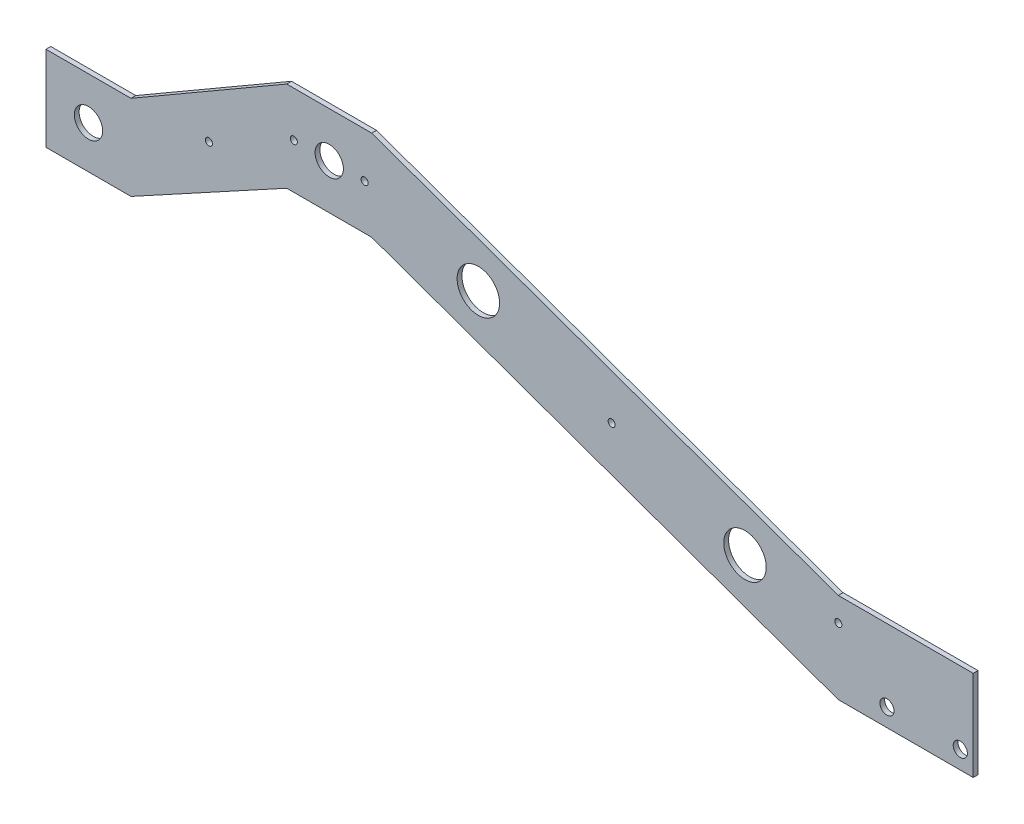
ISO-10303-21;
HEADER;
FILE_DESCRIPTION(('STEP AP214'),'2;1');
FILE_NAME('part.step','',(''),(''),'','','');
FILE_SCHEMA(('AUTOMOTIVE_DESIGN { 1 0 10303 214 1 1 1 1 }'));
ENDSEC;
DATA;
#1=APPLICATION_CONTEXT('core data for automotive mechanical design processes');
#2=APPLICATION_PROTOCOL_DEFINITION('international standard','automotive_design',2000,#1);
#3=PRODUCT_CONTEXT('',#1,'mechanical');
#4=PRODUCT('Part','Part','',(#3));
#5=PRODUCT_RELATED_PRODUCT_CATEGORY('part','',(#4));
#6=PRODUCT_DEFINITION_FORMATION('','',#4);
#7=PRODUCT_DEFINITION_CONTEXT('part definition',#1,'design');
#8=PRODUCT_DEFINITION('design','',#6,#7);
#9=PRODUCT_DEFINITION_SHAPE('','',#8);
#10=(LENGTH_UNIT() NAMED_UNIT(*) SI_UNIT(.MILLI.,.METRE.));
#11=(NAMED_UNIT(*) PLANE_ANGLE_UNIT() SI_UNIT($,.RADIAN.));
#12=(NAMED_UNIT(*) SI_UNIT($,.STERADIAN.) SOLID_ANGLE_UNIT());
#13=UNCERTAINTY_MEASURE_WITH_UNIT(LENGTH_MEASURE(1.E-05),#10,'distance_accuracy_value','');
#14=(GEOMETRIC_REPRESENTATION_CONTEXT(3) GLOBAL_UNCERTAINTY_ASSIGNED_CONTEXT((#13)) GLOBAL_UNIT_ASSIGNED_CONTEXT((#10,
#11,#12)) REPRESENTATION_CONTEXT('',''));
#15=CARTESIAN_POINT('',(0.,0.,0.));
#16=DIRECTION('',(0.,0.,1.));
#17=DIRECTION('',(1.,0.,0.));
#18=AXIS2_PLACEMENT_3D('',#15,#16,#17);
#19=CARTESIAN_POINT('',(0.,63.7314328894491,-3.4));
#20=DIRECTION('',(0.,1.,0.));
#21=DIRECTION('',(-1.,0.,0.));
#22=AXIS2_PLACEMENT_3D('',#19,#20,#21);
#23=PLANE('',#22);
#24=DIRECTION('',(-1.,0.,0.));
#25=VECTOR('',#24,1.);
#26=CARTESIAN_POINT('',(0.,63.7314328894491,0.));
#27=LINE('',#26,#25);
#28=CARTESIAN_POINT('',(0.,63.7314328894491,0.));
#29=VERTEX_POINT('',#28);
#30=CARTESIAN_POINT('',(-95.2463036271757,63.7314328894491,0.));
#31=VERTEX_POINT('',#30);
#32=EDGE_CURVE('E159',#29,#31,#27,.T.);
#33=ORIENTED_EDGE('',*,*,#32,.F.);
#34=DIRECTION('',(0.,0.,1.));
#35=VECTOR('',#34,1.);
#36=CARTESIAN_POINT('',(0.,63.7314328894491,-3.4));
#37=LINE('',#36,#35);
#38=CARTESIAN_POINT('',(0.,63.7314328894491,-3.4));
#39=VERTEX_POINT('',#38);
#40=EDGE_CURVE('E11',#39,#29,#37,.T.);
#41=ORIENTED_EDGE('',*,*,#40,.F.);
#42=DIRECTION('',(-1.,0.,0.));
#43=VECTOR('',#42,1.);
#44=CARTESIAN_POINT('',(0.,63.7314328894491,-3.4));
#45=LINE('',#44,#43);
#46=CARTESIAN_POINT('',(-95.2463036271757,63.7314328894491,-3.4));
#47=VERTEX_POINT('',#46);
#48=EDGE_CURVE('E192',#39,#47,#45,.T.);
#49=ORIENTED_EDGE('',*,*,#48,.T.);
#50=DIRECTION('',(0.,0.,1.));
#51=VECTOR('',#50,1.);
#52=CARTESIAN_POINT('',(-95.2463036271757,63.7314328894491,-3.4));
#53=LINE('',#52,#51);
#54=EDGE_CURVE('E41',#47,#31,#53,.T.);
#55=ORIENTED_EDGE('',*,*,#54,.T.);
#56=EDGE_LOOP('',(#33,#41,#49,#55));
#57=FACE_BOUND('',#56,.T.);
#58=ADVANCED_FACE('F38',(#57),#23,.T.);
#59=CARTESIAN_POINT('',(0.,63.7314328894491,-3.4));
#60=DIRECTION('',(1.,0.,0.));
#61=DIRECTION('',(0.,1.,0.));
#62=AXIS2_PLACEMENT_3D('',#59,#60,#61);
#63=PLANE('',#62);
#64=DIRECTION('',(0.,1.,0.));
#65=VECTOR('',#64,1.);
#66=CARTESIAN_POINT('',(0.,63.7314328894491,0.));
#67=LINE('',#66,#65);
#68=CARTESIAN_POINT('',(0.,0.,0.));
#69=VERTEX_POINT('',#68);
#70=EDGE_CURVE('E190',#69,#29,#67,.T.);
#71=ORIENTED_EDGE('',*,*,#70,.F.);
#72=DIRECTION('',(0.,0.,1.));
#73=VECTOR('',#72,1.);
#74=CARTESIAN_POINT('',(0.,0.,-3.4));
#75=LINE('',#74,#73);
#76=CARTESIAN_POINT('',(0.,0.,-3.4));
#77=VERTEX_POINT('',#76);
#78=EDGE_CURVE('E47',#77,#69,#75,.T.);
#79=ORIENTED_EDGE('',*,*,#78,.F.);
#80=DIRECTION('',(0.,1.,0.));
#81=VECTOR('',#80,1.);
#82=CARTESIAN_POINT('',(0.,63.7314328894491,-3.4));
#83=LINE('',#82,#81);
#84=EDGE_CURVE('E149',#77,#39,#83,.T.);
#85=ORIENTED_EDGE('',*,*,#84,.T.);
#86=ORIENTED_EDGE('',*,*,#40,.T.);
#87=EDGE_LOOP('',(#71,#79,#85,#86));
#88=FACE_BOUND('',#87,.T.);
#89=ADVANCED_FACE('F212',(#88),#63,.T.);
#90=CARTESIAN_POINT('',(0.,0.,-3.4));
#91=DIRECTION('',(0.,-1.,0.));
#92=DIRECTION('',(1.,0.,0.));
#93=AXIS2_PLACEMENT_3D('',#90,#91,#92);
#94=PLANE('',#93);
#95=DIRECTION('',(1.,0.,0.));
#96=VECTOR('',#95,1.);
#97=CARTESIAN_POINT('',(0.,0.,0.));
#98=LINE('',#97,#96);
#99=CARTESIAN_POINT('',(-95.2463036271756,0.,0.));
#100=VERTEX_POINT('',#99);
#101=EDGE_CURVE('E136',#100,#69,#98,.T.);
#102=ORIENTED_EDGE('',*,*,#101,.F.);
#103=DIRECTION('',(0.,0.,1.));
#104=VECTOR('',#103,1.);
#105=CARTESIAN_POINT('',(-95.2463036271756,0.,-3.4));
#106=LINE('',#105,#104);
#107=CARTESIAN_POINT('',(-95.2463036271756,0.,-3.4));
#108=VERTEX_POINT('',#107);
#109=EDGE_CURVE('E131',#108,#100,#106,.T.);
#110=ORIENTED_EDGE('',*,*,#109,.F.);
#111=DIRECTION('',(1.,0.,0.));
#112=VECTOR('',#111,1.);
#113=CARTESIAN_POINT('',(0.,0.,-3.4));
#114=LINE('',#113,#112);
#115=EDGE_CURVE('E134',#108,#77,#114,.T.);
#116=ORIENTED_EDGE('',*,*,#115,.T.);
#117=ORIENTED_EDGE('',*,*,#78,.T.);
#118=EDGE_LOOP('',(#102,#110,#116,#117));
#119=FACE_BOUND('',#118,.T.);
#120=ADVANCED_FACE('F133',(#119),#94,.T.);
#121=CARTESIAN_POINT('',(-424.746303627176,118.,-3.4));
#122=DIRECTION('',(-0.337150769957865,-0.941450666958614,0.));
#123=DIRECTION('',(0.941450666958614,-0.337150769957865,0.));
#124=AXIS2_PLACEMENT_3D('',#121,#122,#123);
#125=PLANE('',#124);
#126=DIRECTION('',(0.941450666958614,-0.337150769957865,0.));
#127=VECTOR('',#126,1.);
#128=CARTESIAN_POINT('',(-424.746303627176,118.,0.));
#129=LINE('',#128,#127);
#130=CARTESIAN_POINT('',(-424.746303627176,118.,0.));
#131=VERTEX_POINT('',#130);
#132=EDGE_CURVE('E187',#131,#100,#129,.T.);
#133=ORIENTED_EDGE('',*,*,#132,.F.);
#134=DIRECTION('',(0.,0.,1.));
#135=VECTOR('',#134,1.);
#136=CARTESIAN_POINT('',(-424.746303627176,118.,-3.4));
#137=LINE('',#136,#135);
#138=CARTESIAN_POINT('',(-424.746303627176,118.,-3.4));
#139=VERTEX_POINT('',#138);
#140=EDGE_CURVE('E141',#139,#131,#137,.T.);
#141=ORIENTED_EDGE('',*,*,#140,.F.);
#142=DIRECTION('',(0.941450666958614,-0.337150769957865,0.));
#143=VECTOR('',#142,1.);
#144=CARTESIAN_POINT('',(-424.746303627176,118.,-3.4));
#145=LINE('',#144,#143);
#146=EDGE_CURVE('E147',#139,#108,#145,.T.);
#147=ORIENTED_EDGE('',*,*,#146,.T.);
#148=ORIENTED_EDGE('',*,*,#109,.T.);
#149=EDGE_LOOP('',(#133,#141,#147,#148));
#150=FACE_BOUND('',#149,.T.);
#151=ADVANCED_FACE('F151',(#150),#125,.T.);
#152=CARTESIAN_POINT('',(-484.746303627176,118.,-3.4));
#153=DIRECTION('',(0.,-1.,0.));
#154=DIRECTION('',(0.,0.,-1.));
#155=AXIS2_PLACEMENT_3D('',#152,#153,#154);
#156=PLANE('',#155);
#157=DIRECTION('',(1.,0.,0.));
#158=VECTOR('',#157,1.);
#159=CARTESIAN_POINT('',(-484.746303627176,118.,0.));
#160=LINE('',#159,#158);
#161=CARTESIAN_POINT('',(-484.746303627176,118.,0.));
#162=VERTEX_POINT('',#161);
#163=EDGE_CURVE('E184',#162,#131,#160,.T.);
#164=ORIENTED_EDGE('',*,*,#163,.F.);
#165=DIRECTION('',(0.,0.,1.));
#166=VECTOR('',#165,1.);
#167=CARTESIAN_POINT('',(-484.746303627176,118.,-3.4));
#168=LINE('',#167,#166);
#169=CARTESIAN_POINT('',(-484.746303627176,118.,-3.4));
#170=VERTEX_POINT('',#169);
#171=EDGE_CURVE('E196',#170,#162,#168,.T.);
#172=ORIENTED_EDGE('',*,*,#171,.F.);
#173=DIRECTION('',(1.,0.,0.));
#174=VECTOR('',#173,1.);
#175=CARTESIAN_POINT('',(-484.746303627176,118.,-3.4));
#176=LINE('',#175,#174);
#177=EDGE_CURVE('E152',#170,#139,#176,.T.);
#178=ORIENTED_EDGE('',*,*,#177,.T.);
#179=ORIENTED_EDGE('',*,*,#140,.T.);
#180=EDGE_LOOP('',(#164,#172,#178,#179));
#181=FACE_BOUND('',#180,.T.);
#182=ADVANCED_FACE('F225',(#181),#156,.T.);
#183=CARTESIAN_POINT('',(-594.746303627176,58.,-3.4));
#184=DIRECTION('',(0.478852130680573,-0.877895572914384,0.));
#185=DIRECTION('',(0.877895572914384,0.478852130680573,0.));
#186=AXIS2_PLACEMENT_3D('',#183,#184,#185);
#187=PLANE('',#186);
#188=DIRECTION('',(0.877895572914384,0.478852130680573,0.));
#189=VECTOR('',#188,1.);
#190=CARTESIAN_POINT('',(-594.746303627176,58.,0.));
#191=LINE('',#190,#189);
#192=CARTESIAN_POINT('',(-594.746303627176,58.,0.));
#193=VERTEX_POINT('',#192);
#194=EDGE_CURVE('E181',#193,#162,#191,.T.);
#195=ORIENTED_EDGE('',*,*,#194,.F.);
#196=DIRECTION('',(0.,0.,1.));
#197=VECTOR('',#196,1.);
#198=CARTESIAN_POINT('',(-594.746303627176,58.,-3.4));
#199=LINE('',#198,#197);
#200=CARTESIAN_POINT('',(-594.746303627176,58.,-3.4));
#201=VERTEX_POINT('',#200);
#202=EDGE_CURVE('E198',#201,#193,#199,.T.);
#203=ORIENTED_EDGE('',*,*,#202,.F.);
#204=DIRECTION('',(0.877895572914384,0.478852130680573,0.));
#205=VECTOR('',#204,1.);
#206=CARTESIAN_POINT('',(-594.746303627176,58.,-3.4));
#207=LINE('',#206,#205);
#208=EDGE_CURVE('E154',#201,#170,#207,.T.);
#209=ORIENTED_EDGE('',*,*,#208,.T.);
#210=ORIENTED_EDGE('',*,*,#171,.T.);
#211=EDGE_LOOP('',(#195,#203,#209,#210));
#212=FACE_BOUND('',#211,.T.);
#213=ADVANCED_FACE('F228',(#212),#187,.T.);
#214=CARTESIAN_POINT('',(-654.746303627176,58.,-3.4));
#215=DIRECTION('',(0.,-1.,0.));
#216=DIRECTION('',(0.,0.,-1.));
#217=AXIS2_PLACEMENT_3D('',#214,#215,#216);
#218=PLANE('',#217);
#219=DIRECTION('',(1.,0.,0.));
#220=VECTOR('',#219,1.);
#221=CARTESIAN_POINT('',(-654.746303627176,58.,0.));
#222=LINE('',#221,#220);
#223=CARTESIAN_POINT('',(-654.746303627176,58.,0.));
#224=VERTEX_POINT('',#223);
#225=EDGE_CURVE('E178',#224,#193,#222,.T.);
#226=ORIENTED_EDGE('',*,*,#225,.F.);
#227=DIRECTION('',(0.,0.,1.));
#228=VECTOR('',#227,1.);
#229=CARTESIAN_POINT('',(-654.746303627176,58.,-3.4));
#230=LINE('',#229,#228);
#231=CARTESIAN_POINT('',(-654.746303627176,58.,-3.4));
#232=VERTEX_POINT('',#231);
#233=EDGE_CURVE('E200',#232,#224,#230,.T.);
#234=ORIENTED_EDGE('',*,*,#233,.F.);
#235=DIRECTION('',(1.,0.,0.));
#236=VECTOR('',#235,1.);
#237=CARTESIAN_POINT('',(-654.746303627176,58.,-3.4));
#238=LINE('',#237,#236);
#239=EDGE_CURVE('E392',#232,#201,#238,.T.);
#240=ORIENTED_EDGE('',*,*,#239,.T.);
#241=ORIENTED_EDGE('',*,*,#202,.T.);
#242=EDGE_LOOP('',(#226,#234,#240,#241));
#243=FACE_BOUND('',#242,.T.);
#244=ADVANCED_FACE('F232',(#243),#218,.T.);
#245=CARTESIAN_POINT('',(-654.746303627176,118.,-3.4));
#246=DIRECTION('',(-1.,0.,0.));
#247=DIRECTION('',(0.,0.,1.));
#248=AXIS2_PLACEMENT_3D('',#245,#246,#247);
#249=PLANE('',#248);
#250=DIRECTION('',(0.,-1.,0.));
#251=VECTOR('',#250,1.);
#252=CARTESIAN_POINT('',(-654.746303627176,118.,0.));
#253=LINE('',#252,#251);
#254=CARTESIAN_POINT('',(-654.746303627176,118.,0.));
#255=VERTEX_POINT('',#254);
#256=EDGE_CURVE('E175',#255,#224,#253,.T.);
#257=ORIENTED_EDGE('',*,*,#256,.F.);
#258=DIRECTION('',(0.,0.,1.));
#259=VECTOR('',#258,1.);
#260=CARTESIAN_POINT('',(-654.746303627176,118.,-3.4));
#261=LINE('',#260,#259);
#262=CARTESIAN_POINT('',(-654.746303627176,118.,-3.4));
#263=VERTEX_POINT('',#262);
#264=EDGE_CURVE('E202',#263,#255,#261,.T.);
#265=ORIENTED_EDGE('',*,*,#264,.F.);
#266=DIRECTION('',(0.,-1.,0.));
#267=VECTOR('',#266,1.);
#268=CARTESIAN_POINT('',(-654.746303627176,118.,-3.4));
#269=LINE('',#268,#267);
#270=EDGE_CURVE('E389',#263,#232,#269,.T.);
#271=ORIENTED_EDGE('',*,*,#270,.T.);
#272=ORIENTED_EDGE('',*,*,#233,.T.);
#273=EDGE_LOOP('',(#257,#265,#271,#272));
#274=FACE_BOUND('',#273,.T.);
#275=ADVANCED_FACE('F236',(#274),#249,.T.);
#276=CARTESIAN_POINT('',(-594.746303627176,118.,-3.4));
#277=DIRECTION('',(0.,1.,0.));
#278=DIRECTION('',(-1.,0.,0.));
#279=AXIS2_PLACEMENT_3D('',#276,#277,#278);
#280=PLANE('',#279);
#281=DIRECTION('',(-1.,0.,0.));
#282=VECTOR('',#281,1.);
#283=CARTESIAN_POINT('',(-594.746303627176,118.,0.));
#284=LINE('',#283,#282);
#285=CARTESIAN_POINT('',(-594.746303627176,118.,0.));
#286=VERTEX_POINT('',#285);
#287=EDGE_CURVE('E172',#286,#255,#284,.T.);
#288=ORIENTED_EDGE('',*,*,#287,.F.);
#289=DIRECTION('',(0.,0.,1.));
#290=VECTOR('',#289,1.);
#291=CARTESIAN_POINT('',(-594.746303627176,118.,-3.4));
#292=LINE('',#291,#290);
#293=CARTESIAN_POINT('',(-594.746303627176,118.,-3.4));
#294=VERTEX_POINT('',#293);
#295=EDGE_CURVE('E204',#294,#286,#292,.T.);
#296=ORIENTED_EDGE('',*,*,#295,.F.);
#297=DIRECTION('',(-1.,0.,0.));
#298=VECTOR('',#297,1.);
#299=CARTESIAN_POINT('',(-594.746303627176,118.,-3.4));
#300=LINE('',#299,#298);
#301=EDGE_CURVE('E386',#294,#263,#300,.T.);
#302=ORIENTED_EDGE('',*,*,#301,.T.);
#303=ORIENTED_EDGE('',*,*,#264,.T.);
#304=EDGE_LOOP('',(#288,#296,#302,#303));
#305=FACE_BOUND('',#304,.T.);
#306=ADVANCED_FACE('F240',(#305),#280,.T.);
#307=CARTESIAN_POINT('',(-484.746303627176,181.731432889449,-3.4));
#308=DIRECTION('',(-0.501314449325586,0.865265174901535,0.));
#309=DIRECTION('',(-0.865265174901535,-0.501314449325587,0.));
#310=AXIS2_PLACEMENT_3D('',#307,#308,#309);
#311=PLANE('',#310);
#312=DIRECTION('',(-0.865265174901535,-0.501314449325586,0.));
#313=VECTOR('',#312,1.);
#314=CARTESIAN_POINT('',(-484.746303627176,181.731432889449,0.));
#315=LINE('',#314,#313);
#316=CARTESIAN_POINT('',(-484.746303627176,181.731432889449,0.));
#317=VERTEX_POINT('',#316);
#318=EDGE_CURVE('E169',#317,#286,#315,.T.);
#319=ORIENTED_EDGE('',*,*,#318,.F.);
#320=DIRECTION('',(0.,0.,1.));
#321=VECTOR('',#320,1.);
#322=CARTESIAN_POINT('',(-484.746303627176,181.731432889449,-3.4));
#323=LINE('',#322,#321);
#324=CARTESIAN_POINT('',(-484.746303627176,181.731432889449,-3.4));
#325=VERTEX_POINT('',#324);
#326=EDGE_CURVE('E206',#325,#317,#323,.T.);
#327=ORIENTED_EDGE('',*,*,#326,.F.);
#328=DIRECTION('',(-0.865265174901535,-0.501314449325586,0.));
#329=VECTOR('',#328,1.);
#330=CARTESIAN_POINT('',(-484.746303627176,181.731432889449,-3.4));
#331=LINE('',#330,#329);
#332=EDGE_CURVE('E383',#325,#294,#331,.T.);
#333=ORIENTED_EDGE('',*,*,#332,.T.);
#334=ORIENTED_EDGE('',*,*,#295,.T.);
#335=EDGE_LOOP('',(#319,#327,#333,#334));
#336=FACE_BOUND('',#335,.T.);
#337=ADVANCED_FACE('F244',(#336),#311,.T.);
#338=CARTESIAN_POINT('',(-424.746303627176,181.731432889449,-3.4));
#339=DIRECTION('',(0.,1.,0.));
#340=DIRECTION('',(-1.,0.,0.));
#341=AXIS2_PLACEMENT_3D('',#338,#339,#340);
#342=PLANE('',#341);
#343=DIRECTION('',(-1.,0.,0.));
#344=VECTOR('',#343,1.);
#345=CARTESIAN_POINT('',(-424.746303627176,181.731432889449,0.));
#346=LINE('',#345,#344);
#347=CARTESIAN_POINT('',(-424.746303627176,181.731432889449,0.));
#348=VERTEX_POINT('',#347);
#349=EDGE_CURVE('E166',#348,#317,#346,.T.);
#350=ORIENTED_EDGE('',*,*,#349,.F.);
#351=DIRECTION('',(0.,0.,1.));
#352=VECTOR('',#351,1.);
#353=CARTESIAN_POINT('',(-424.746303627176,181.731432889449,-3.4));
#354=LINE('',#353,#352);
#355=CARTESIAN_POINT('',(-424.746303627176,181.731432889449,-3.4));
#356=VERTEX_POINT('',#355);
#357=EDGE_CURVE('E207',#356,#348,#354,.T.);
#358=ORIENTED_EDGE('',*,*,#357,.F.);
#359=DIRECTION('',(-1.,0.,0.));
#360=VECTOR('',#359,1.);
#361=CARTESIAN_POINT('',(-424.746303627176,181.731432889449,-3.4));
#362=LINE('',#361,#360);
#363=EDGE_CURVE('E380',#356,#325,#362,.T.);
#364=ORIENTED_EDGE('',*,*,#363,.T.);
#365=ORIENTED_EDGE('',*,*,#326,.T.);
#366=EDGE_LOOP('',(#350,#358,#364,#365));
#367=FACE_BOUND('',#366,.T.);
#368=ADVANCED_FACE('F248',(#367),#342,.T.);
#369=CARTESIAN_POINT('',(-95.2463036271757,63.7314328894491,-3.4));
#370=DIRECTION('',(0.337150769957864,0.941450666958614,0.));
#371=DIRECTION('',(-0.941450666958614,0.337150769957864,0.));
#372=AXIS2_PLACEMENT_3D('',#369,#370,#371);
#373=PLANE('',#372);
#374=DIRECTION('',(-0.941450666958614,0.337150769957864,0.));
#375=VECTOR('',#374,1.);
#376=CARTESIAN_POINT('',(-95.2463036271757,63.7314328894491,0.));
#377=LINE('',#376,#375);
#378=EDGE_CURVE('E162',#31,#348,#377,.T.);
#379=ORIENTED_EDGE('',*,*,#378,.F.);
#380=ORIENTED_EDGE('',*,*,#54,.F.);
#381=DIRECTION('',(-0.941450666958614,0.337150769957864,0.));
#382=VECTOR('',#381,1.);
#383=CARTESIAN_POINT('',(-95.2463036271757,63.7314328894491,-3.4));
#384=LINE('',#383,#382);
#385=EDGE_CURVE('E378',#47,#356,#384,.T.);
#386=ORIENTED_EDGE('',*,*,#385,.T.);
#387=ORIENTED_EDGE('',*,*,#357,.T.);
#388=EDGE_LOOP('',(#379,#380,#386,#387));
#389=FACE_BOUND('',#388,.T.);
#390=ADVANCED_FACE('F209',(#389),#373,.T.);
#391=CARTESIAN_POINT('',(0.,0.,-3.4));
#392=DIRECTION('',(0.,0.,1.));
#393=DIRECTION('',(1.,0.,0.));
#394=AXIS2_PLACEMENT_3D('',#391,#392,#393);
#395=PLANE('',#394);
#396=CARTESIAN_POINT('',(-9.1,12.7,-3.4));
#397=DIRECTION('',(0.,0.,1.));
#398=DIRECTION('',(-1.,0.,0.));
#399=AXIS2_PLACEMENT_3D('',#396,#397,#398);
#400=CIRCLE('',#399,5.);
#401=CARTESIAN_POINT('',(-14.1,12.7,-3.4));
#402=VERTEX_POINT('',#401);
#403=EDGE_CURVE('E311',#402,#402,#400,.T.);
#404=ORIENTED_EDGE('',*,*,#403,.T.);
#405=EDGE_LOOP('',(#404));
#406=FACE_BOUND('',#405,.T.);
#407=CARTESIAN_POINT('',(-95.2463036271757,46.8657164447245,-3.4));
#408=DIRECTION('',(0.,0.,1.));
#409=DIRECTION('',(1.,0.,0.));
#410=AXIS2_PLACEMENT_3D('',#407,#408,#409);
#411=CIRCLE('',#410,2.50000000000001);
#412=CARTESIAN_POINT('',(-92.7463036271756,46.8657164447245,-3.4));
#413=VERTEX_POINT('',#412);
#414=EDGE_CURVE('E319',#413,#413,#411,.T.);
#415=ORIENTED_EDGE('',*,*,#414,.T.);
#416=EDGE_LOOP('',(#415));
#417=FACE_BOUND('',#416,.T.);
#418=CARTESIAN_POINT('',(-60.9,12.7,-3.4));
#419=DIRECTION('',(0.,0.,1.));
#420=DIRECTION('',(1.,0.,0.));
#421=AXIS2_PLACEMENT_3D('',#418,#419,#420);
#422=CIRCLE('',#421,5.);
#423=CARTESIAN_POINT('',(-55.9,12.7,-3.4));
#424=VERTEX_POINT('',#423);
#425=EDGE_CURVE('E325',#424,#424,#422,.T.);
#426=ORIENTED_EDGE('',*,*,#425,.T.);
#427=EDGE_LOOP('',(#426));
#428=FACE_BOUND('',#427,.T.);
#429=CARTESIAN_POINT('',(-479.746303627176,149.865716444724,-3.4));
#430=DIRECTION('',(0.,0.,1.));
#431=DIRECTION('',(1.,0.,0.));
#432=AXIS2_PLACEMENT_3D('',#429,#430,#431);
#433=CIRCLE('',#432,2.50000000000002);
#434=CARTESIAN_POINT('',(-477.246303627176,149.865716444724,-3.4));
#435=VERTEX_POINT('',#434);
#436=EDGE_CURVE('E331',#435,#435,#433,.T.);
#437=ORIENTED_EDGE('',*,*,#436,.T.);
#438=EDGE_LOOP('',(#437));
#439=FACE_BOUND('',#438,.T.);
#440=CARTESIAN_POINT('',(-429.746303627176,149.865716444724,-3.4));
#441=DIRECTION('',(0.,0.,1.));
#442=DIRECTION('',(1.,0.,0.));
#443=AXIS2_PLACEMENT_3D('',#440,#441,#442);
#444=CIRCLE('',#443,2.50000000000002);
#445=CARTESIAN_POINT('',(-427.246303627176,149.865716444724,-3.4));
#446=VERTEX_POINT('',#445);
#447=EDGE_CURVE('E337',#446,#446,#444,.T.);
#448=ORIENTED_EDGE('',*,*,#447,.T.);
#449=EDGE_LOOP('',(#448));
#450=FACE_BOUND('',#449,.T.);
#451=CARTESIAN_POINT('',(-349.437983706001,122.896424333348,-3.4));
#452=DIRECTION('',(0.,0.,1.));
#453=DIRECTION('',(1.,0.,0.));
#454=AXIS2_PLACEMENT_3D('',#451,#452,#453);
#455=CIRCLE('',#454,15.);
#456=CARTESIAN_POINT('',(-334.437983706001,122.896424333348,-3.4));
#457=VERTEX_POINT('',#456);
#458=EDGE_CURVE('E343',#457,#457,#455,.T.);
#459=ORIENTED_EDGE('',*,*,#458,.T.);
#460=EDGE_LOOP('',(#459));
#461=FACE_BOUND('',#460,.T.);
#462=CARTESIAN_POINT('',(-255.29291701014,89.1813473375615,-3.4));
#463=DIRECTION('',(0.,0.,1.));
#464=DIRECTION('',(1.,0.,0.));
#465=AXIS2_PLACEMENT_3D('',#462,#463,#464);
#466=CIRCLE('',#465,2.50000000000002);
#467=CARTESIAN_POINT('',(-252.79291701014,89.1813473375615,-3.4));
#468=VERTEX_POINT('',#467);
#469=EDGE_CURVE('E349',#468,#468,#466,.T.);
#470=ORIENTED_EDGE('',*,*,#469,.T.);
#471=EDGE_LOOP('',(#470));
#472=FACE_BOUND('',#471,.T.);
#473=CARTESIAN_POINT('',(-161.147850314279,55.466270341775,-3.4));
#474=DIRECTION('',(0.,0.,1.));
#475=DIRECTION('',(1.,0.,0.));
#476=AXIS2_PLACEMENT_3D('',#473,#474,#475);
#477=CIRCLE('',#476,15.);
#478=CARTESIAN_POINT('',(-146.147850314279,55.466270341775,-3.4));
#479=VERTEX_POINT('',#478);
#480=EDGE_CURVE('E355',#479,#479,#477,.T.);
#481=ORIENTED_EDGE('',*,*,#480,.T.);
#482=EDGE_LOOP('',(#481));
#483=FACE_BOUND('',#482,.T.);
#484=CARTESIAN_POINT('',(-539.746303627176,118.932858222362,-3.4));
#485=DIRECTION('',(0.,0.,1.));
#486=DIRECTION('',(1.,0.,0.));
#487=AXIS2_PLACEMENT_3D('',#484,#485,#486);
#488=CIRCLE('',#487,2.49999999999991);
#489=CARTESIAN_POINT('',(-537.246303627176,118.932858222362,-3.4));
#490=VERTEX_POINT('',#489);
#491=EDGE_CURVE('E361',#490,#490,#488,.T.);
#492=ORIENTED_EDGE('',*,*,#491,.T.);
#493=EDGE_LOOP('',(#492));
#494=FACE_BOUND('',#493,.T.);
#495=CARTESIAN_POINT('',(-454.746303627176,149.865716444724,-3.4));
#496=DIRECTION('',(0.,0.,1.));
#497=DIRECTION('',(1.,0.,0.));
#498=AXIS2_PLACEMENT_3D('',#495,#496,#497);
#499=CIRCLE('',#498,9.99999999999998);
#500=CARTESIAN_POINT('',(-444.746303627176,149.865716444724,-3.4));
#501=VERTEX_POINT('',#500);
#502=EDGE_CURVE('E367',#501,#501,#499,.T.);
#503=ORIENTED_EDGE('',*,*,#502,.T.);
#504=EDGE_LOOP('',(#503));
#505=FACE_BOUND('',#504,.T.);
#506=CARTESIAN_POINT('',(-624.746303627176,88.,-3.4));
#507=DIRECTION('',(0.,0.,1.));
#508=DIRECTION('',(1.,0.,0.));
#509=AXIS2_PLACEMENT_3D('',#506,#507,#508);
#510=CIRCLE('',#509,9.99999999999998);
#511=CARTESIAN_POINT('',(-614.746303627176,88.,-3.4));
#512=VERTEX_POINT('',#511);
#513=EDGE_CURVE('E163',#512,#512,#510,.T.);
#514=ORIENTED_EDGE('',*,*,#513,.T.);
#515=EDGE_LOOP('',(#514));
#516=FACE_BOUND('',#515,.T.);
#517=ORIENTED_EDGE('',*,*,#48,.F.);
#518=ORIENTED_EDGE('',*,*,#84,.F.);
#519=ORIENTED_EDGE('',*,*,#115,.F.);
#520=ORIENTED_EDGE('',*,*,#146,.F.);
#521=ORIENTED_EDGE('',*,*,#177,.F.);
#522=ORIENTED_EDGE('',*,*,#208,.F.);
#523=ORIENTED_EDGE('',*,*,#239,.F.);
#524=ORIENTED_EDGE('',*,*,#270,.F.);
#525=ORIENTED_EDGE('',*,*,#301,.F.);
#526=ORIENTED_EDGE('',*,*,#332,.F.);
#527=ORIENTED_EDGE('',*,*,#363,.F.);
#528=ORIENTED_EDGE('',*,*,#385,.F.);
#529=EDGE_LOOP('',(#517,#518,#519,#520,#521,#522,#523,#524,#525,#526,#527,#528));
#530=FACE_BOUND('',#529,.T.);
#531=ADVANCED_FACE('F145',(#406,#417,#428,#439,#450,#461,#472,#483,#494,#505,#516,#530),#395,.F.);
#532=CARTESIAN_POINT('',(0.,0.,0.));
#533=DIRECTION('',(0.,0.,1.));
#534=DIRECTION('',(1.,0.,0.));
#535=AXIS2_PLACEMENT_3D('',#532,#533,#534);
#536=PLANE('',#535);
#537=CARTESIAN_POINT('',(-9.1,12.7,0.));
#538=DIRECTION('',(0.,0.,1.));
#539=DIRECTION('',(-1.,0.,0.));
#540=AXIS2_PLACEMENT_3D('',#537,#538,#539);
#541=CIRCLE('',#540,5.);
#542=CARTESIAN_POINT('',(-14.1,12.7,0.));
#543=VERTEX_POINT('',#542);
#544=EDGE_CURVE('E314',#543,#543,#541,.T.);
#545=ORIENTED_EDGE('',*,*,#544,.F.);
#546=EDGE_LOOP('',(#545));
#547=FACE_BOUND('',#546,.T.);
#548=CARTESIAN_POINT('',(-95.2463036271757,46.8657164447245,0.));
#549=DIRECTION('',(0.,0.,1.));
#550=DIRECTION('',(1.,0.,0.));
#551=AXIS2_PLACEMENT_3D('',#548,#549,#550);
#552=CIRCLE('',#551,2.50000000000001);
#553=CARTESIAN_POINT('',(-92.7463036271756,46.8657164447245,0.));
#554=VERTEX_POINT('',#553);
#555=EDGE_CURVE('E316',#554,#554,#552,.T.);
#556=ORIENTED_EDGE('',*,*,#555,.F.);
#557=EDGE_LOOP('',(#556));
#558=FACE_BOUND('',#557,.T.);
#559=CARTESIAN_POINT('',(-60.9,12.7,0.));
#560=DIRECTION('',(0.,0.,1.));
#561=DIRECTION('',(1.,0.,0.));
#562=AXIS2_PLACEMENT_3D('',#559,#560,#561);
#563=CIRCLE('',#562,5.);
#564=CARTESIAN_POINT('',(-55.9,12.7,0.));
#565=VERTEX_POINT('',#564);
#566=EDGE_CURVE('E322',#565,#565,#563,.T.);
#567=ORIENTED_EDGE('',*,*,#566,.F.);
#568=EDGE_LOOP('',(#567));
#569=FACE_BOUND('',#568,.T.);
#570=CARTESIAN_POINT('',(-479.746303627176,149.865716444724,0.));
#571=DIRECTION('',(0.,0.,1.));
#572=DIRECTION('',(1.,0.,0.));
#573=AXIS2_PLACEMENT_3D('',#570,#571,#572);
#574=CIRCLE('',#573,2.50000000000002);
#575=CARTESIAN_POINT('',(-477.246303627176,149.865716444724,0.));
#576=VERTEX_POINT('',#575);
#577=EDGE_CURVE('E328',#576,#576,#574,.T.);
#578=ORIENTED_EDGE('',*,*,#577,.F.);
#579=EDGE_LOOP('',(#578));
#580=FACE_BOUND('',#579,.T.);
#581=CARTESIAN_POINT('',(-429.746303627176,149.865716444724,0.));
#582=DIRECTION('',(0.,0.,1.));
#583=DIRECTION('',(1.,0.,0.));
#584=AXIS2_PLACEMENT_3D('',#581,#582,#583);
#585=CIRCLE('',#584,2.50000000000002);
#586=CARTESIAN_POINT('',(-427.246303627176,149.865716444724,0.));
#587=VERTEX_POINT('',#586);
#588=EDGE_CURVE('E334',#587,#587,#585,.T.);
#589=ORIENTED_EDGE('',*,*,#588,.F.);
#590=EDGE_LOOP('',(#589));
#591=FACE_BOUND('',#590,.T.);
#592=CARTESIAN_POINT('',(-349.437983706001,122.896424333348,0.));
#593=DIRECTION('',(0.,0.,1.));
#594=DIRECTION('',(1.,0.,0.));
#595=AXIS2_PLACEMENT_3D('',#592,#593,#594);
#596=CIRCLE('',#595,15.);
#597=CARTESIAN_POINT('',(-334.437983706001,122.896424333348,0.));
#598=VERTEX_POINT('',#597);
#599=EDGE_CURVE('E340',#598,#598,#596,.T.);
#600=ORIENTED_EDGE('',*,*,#599,.F.);
#601=EDGE_LOOP('',(#600));
#602=FACE_BOUND('',#601,.T.);
#603=CARTESIAN_POINT('',(-255.29291701014,89.1813473375615,0.));
#604=DIRECTION('',(0.,0.,1.));
#605=DIRECTION('',(1.,0.,0.));
#606=AXIS2_PLACEMENT_3D('',#603,#604,#605);
#607=CIRCLE('',#606,2.50000000000002);
#608=CARTESIAN_POINT('',(-252.79291701014,89.1813473375615,0.));
#609=VERTEX_POINT('',#608);
#610=EDGE_CURVE('E346',#609,#609,#607,.T.);
#611=ORIENTED_EDGE('',*,*,#610,.F.);
#612=EDGE_LOOP('',(#611));
#613=FACE_BOUND('',#612,.T.);
#614=CARTESIAN_POINT('',(-161.147850314279,55.466270341775,0.));
#615=DIRECTION('',(0.,0.,1.));
#616=DIRECTION('',(1.,0.,0.));
#617=AXIS2_PLACEMENT_3D('',#614,#615,#616);
#618=CIRCLE('',#617,15.);
#619=CARTESIAN_POINT('',(-146.147850314279,55.466270341775,0.));
#620=VERTEX_POINT('',#619);
#621=EDGE_CURVE('E352',#620,#620,#618,.T.);
#622=ORIENTED_EDGE('',*,*,#621,.F.);
#623=EDGE_LOOP('',(#622));
#624=FACE_BOUND('',#623,.T.);
#625=CARTESIAN_POINT('',(-539.746303627176,118.932858222362,0.));
#626=DIRECTION('',(0.,0.,1.));
#627=DIRECTION('',(1.,0.,0.));
#628=AXIS2_PLACEMENT_3D('',#625,#626,#627);
#629=CIRCLE('',#628,2.49999999999991);
#630=CARTESIAN_POINT('',(-537.246303627176,118.932858222362,0.));
#631=VERTEX_POINT('',#630);
#632=EDGE_CURVE('E358',#631,#631,#629,.T.);
#633=ORIENTED_EDGE('',*,*,#632,.F.);
#634=EDGE_LOOP('',(#633));
#635=FACE_BOUND('',#634,.T.);
#636=CARTESIAN_POINT('',(-454.746303627176,149.865716444724,0.));
#637=DIRECTION('',(0.,0.,1.));
#638=DIRECTION('',(1.,0.,0.));
#639=AXIS2_PLACEMENT_3D('',#636,#637,#638);
#640=CIRCLE('',#639,9.99999999999998);
#641=CARTESIAN_POINT('',(-444.746303627176,149.865716444724,0.));
#642=VERTEX_POINT('',#641);
#643=EDGE_CURVE('E364',#642,#642,#640,.T.);
#644=ORIENTED_EDGE('',*,*,#643,.F.);
#645=EDGE_LOOP('',(#644));
#646=FACE_BOUND('',#645,.T.);
#647=CARTESIAN_POINT('',(-624.746303627176,88.,0.));
#648=DIRECTION('',(0.,0.,1.));
#649=DIRECTION('',(1.,0.,0.));
#650=AXIS2_PLACEMENT_3D('',#647,#648,#649);
#651=CIRCLE('',#650,9.99999999999998);
#652=CARTESIAN_POINT('',(-614.746303627176,88.,0.));
#653=VERTEX_POINT('',#652);
#654=EDGE_CURVE('E370',#653,#653,#651,.T.);
#655=ORIENTED_EDGE('',*,*,#654,.F.);
#656=EDGE_LOOP('',(#655));
#657=FACE_BOUND('',#656,.T.);
#658=ORIENTED_EDGE('',*,*,#32,.T.);
#659=ORIENTED_EDGE('',*,*,#378,.T.);
#660=ORIENTED_EDGE('',*,*,#349,.T.);
#661=ORIENTED_EDGE('',*,*,#318,.T.);
#662=ORIENTED_EDGE('',*,*,#287,.T.);
#663=ORIENTED_EDGE('',*,*,#256,.T.);
#664=ORIENTED_EDGE('',*,*,#225,.T.);
#665=ORIENTED_EDGE('',*,*,#194,.T.);
#666=ORIENTED_EDGE('',*,*,#163,.T.);
#667=ORIENTED_EDGE('',*,*,#132,.T.);
#668=ORIENTED_EDGE('',*,*,#101,.T.);
#669=ORIENTED_EDGE('',*,*,#70,.T.);
#670=EDGE_LOOP('',(#658,#659,#660,#661,#662,#663,#664,#665,#666,#667,#668,#669));
#671=FACE_BOUND('',#670,.T.);
#672=ADVANCED_FACE('F211',(#547,#558,#569,#580,#591,#602,#613,#624,#635,#646,#657,#671),#536,.T.);
#673=CARTESIAN_POINT('',(-624.746303627176,88.,-3.4));
#674=DIRECTION('',(0.,0.,1.));
#675=DIRECTION('',(1.,0.,0.));
#676=AXIS2_PLACEMENT_3D('',#673,#674,#675);
#677=CYLINDRICAL_SURFACE('',#676,9.99999999999998);
#678=ORIENTED_EDGE('',*,*,#513,.F.);
#679=EDGE_LOOP('',(#678));
#680=FACE_BOUND('',#679,.T.);
#681=ORIENTED_EDGE('',*,*,#654,.T.);
#682=EDGE_LOOP('',(#681));
#683=FACE_BOUND('',#682,.T.);
#684=ADVANCED_FACE('F260',(#680,#683),#677,.F.);
#685=CARTESIAN_POINT('',(-454.746303627176,149.865716444724,-3.4));
#686=DIRECTION('',(0.,0.,1.));
#687=DIRECTION('',(1.,0.,0.));
#688=AXIS2_PLACEMENT_3D('',#685,#686,#687);
#689=CYLINDRICAL_SURFACE('',#688,9.99999999999998);
#690=ORIENTED_EDGE('',*,*,#502,.F.);
#691=EDGE_LOOP('',(#690));
#692=FACE_BOUND('',#691,.T.);
#693=ORIENTED_EDGE('',*,*,#643,.T.);
#694=EDGE_LOOP('',(#693));
#695=FACE_BOUND('',#694,.T.);
#696=ADVANCED_FACE('F267',(#692,#695),#689,.F.);
#697=CARTESIAN_POINT('',(-539.746303627176,118.932858222362,-3.4));
#698=DIRECTION('',(0.,0.,1.));
#699=DIRECTION('',(1.,0.,0.));
#700=AXIS2_PLACEMENT_3D('',#697,#698,#699);
#701=CYLINDRICAL_SURFACE('',#700,2.49999999999991);
#702=ORIENTED_EDGE('',*,*,#491,.F.);
#703=EDGE_LOOP('',(#702));
#704=FACE_BOUND('',#703,.T.);
#705=ORIENTED_EDGE('',*,*,#632,.T.);
#706=EDGE_LOOP('',(#705));
#707=FACE_BOUND('',#706,.T.);
#708=ADVANCED_FACE('F271',(#704,#707),#701,.F.);
#709=CARTESIAN_POINT('',(-161.147850314279,55.466270341775,-3.4));
#710=DIRECTION('',(0.,0.,1.));
#711=DIRECTION('',(1.,0.,0.));
#712=AXIS2_PLACEMENT_3D('',#709,#710,#711);
#713=CYLINDRICAL_SURFACE('',#712,15.);
#714=ORIENTED_EDGE('',*,*,#480,.F.);
#715=EDGE_LOOP('',(#714));
#716=FACE_BOUND('',#715,.T.);
#717=ORIENTED_EDGE('',*,*,#621,.T.);
#718=EDGE_LOOP('',(#717));
#719=FACE_BOUND('',#718,.T.);
#720=ADVANCED_FACE('F275',(#716,#719),#713,.F.);
#721=CARTESIAN_POINT('',(-255.29291701014,89.1813473375615,-3.4));
#722=DIRECTION('',(0.,0.,1.));
#723=DIRECTION('',(1.,0.,0.));
#724=AXIS2_PLACEMENT_3D('',#721,#722,#723);
#725=CYLINDRICAL_SURFACE('',#724,2.50000000000002);
#726=ORIENTED_EDGE('',*,*,#469,.F.);
#727=EDGE_LOOP('',(#726));
#728=FACE_BOUND('',#727,.T.);
#729=ORIENTED_EDGE('',*,*,#610,.T.);
#730=EDGE_LOOP('',(#729));
#731=FACE_BOUND('',#730,.T.);
#732=ADVANCED_FACE('F279',(#728,#731),#725,.F.);
#733=CARTESIAN_POINT('',(-349.437983706001,122.896424333348,-3.4));
#734=DIRECTION('',(0.,0.,1.));
#735=DIRECTION('',(1.,0.,0.));
#736=AXIS2_PLACEMENT_3D('',#733,#734,#735);
#737=CYLINDRICAL_SURFACE('',#736,15.);
#738=ORIENTED_EDGE('',*,*,#458,.F.);
#739=EDGE_LOOP('',(#738));
#740=FACE_BOUND('',#739,.T.);
#741=ORIENTED_EDGE('',*,*,#599,.T.);
#742=EDGE_LOOP('',(#741));
#743=FACE_BOUND('',#742,.T.);
#744=ADVANCED_FACE('F283',(#740,#743),#737,.F.);
#745=CARTESIAN_POINT('',(-429.746303627176,149.865716444724,-3.4));
#746=DIRECTION('',(0.,0.,1.));
#747=DIRECTION('',(1.,0.,0.));
#748=AXIS2_PLACEMENT_3D('',#745,#746,#747);
#749=CYLINDRICAL_SURFACE('',#748,2.50000000000002);
#750=ORIENTED_EDGE('',*,*,#447,.F.);
#751=EDGE_LOOP('',(#750));
#752=FACE_BOUND('',#751,.T.);
#753=ORIENTED_EDGE('',*,*,#588,.T.);
#754=EDGE_LOOP('',(#753));
#755=FACE_BOUND('',#754,.T.);
#756=ADVANCED_FACE('F287',(#752,#755),#749,.F.);
#757=CARTESIAN_POINT('',(-479.746303627176,149.865716444724,-3.4));
#758=DIRECTION('',(0.,0.,1.));
#759=DIRECTION('',(1.,0.,0.));
#760=AXIS2_PLACEMENT_3D('',#757,#758,#759);
#761=CYLINDRICAL_SURFACE('',#760,2.50000000000002);
#762=ORIENTED_EDGE('',*,*,#436,.F.);
#763=EDGE_LOOP('',(#762));
#764=FACE_BOUND('',#763,.T.);
#765=ORIENTED_EDGE('',*,*,#577,.T.);
#766=EDGE_LOOP('',(#765));
#767=FACE_BOUND('',#766,.T.);
#768=ADVANCED_FACE('F291',(#764,#767),#761,.F.);
#769=CARTESIAN_POINT('',(-60.9,12.7,-3.4));
#770=DIRECTION('',(0.,0.,1.));
#771=DIRECTION('',(1.,0.,0.));
#772=AXIS2_PLACEMENT_3D('',#769,#770,#771);
#773=CYLINDRICAL_SURFACE('',#772,5.);
#774=ORIENTED_EDGE('',*,*,#425,.F.);
#775=EDGE_LOOP('',(#774));
#776=FACE_BOUND('',#775,.T.);
#777=ORIENTED_EDGE('',*,*,#566,.T.);
#778=EDGE_LOOP('',(#777));
#779=FACE_BOUND('',#778,.T.);
#780=ADVANCED_FACE('F295',(#776,#779),#773,.F.);
#781=CARTESIAN_POINT('',(-95.2463036271757,46.8657164447245,-3.4));
#782=DIRECTION('',(0.,0.,1.));
#783=DIRECTION('',(1.,0.,0.));
#784=AXIS2_PLACEMENT_3D('',#781,#782,#783);
#785=CYLINDRICAL_SURFACE('',#784,2.50000000000001);
#786=ORIENTED_EDGE('',*,*,#414,.F.);
#787=EDGE_LOOP('',(#786));
#788=FACE_BOUND('',#787,.T.);
#789=ORIENTED_EDGE('',*,*,#555,.T.);
#790=EDGE_LOOP('',(#789));
#791=FACE_BOUND('',#790,.T.);
#792=ADVANCED_FACE('F299',(#788,#791),#785,.F.);
#793=CARTESIAN_POINT('',(-9.1,12.7,-3.4));
#794=DIRECTION('',(0.,0.,1.));
#795=DIRECTION('',(1.,0.,0.));
#796=AXIS2_PLACEMENT_3D('',#793,#794,#795);
#797=CYLINDRICAL_SURFACE('',#796,5.);
#798=ORIENTED_EDGE('',*,*,#403,.F.);
#799=EDGE_LOOP('',(#798));
#800=FACE_BOUND('',#799,.T.);
#801=ORIENTED_EDGE('',*,*,#544,.T.);
#802=EDGE_LOOP('',(#801));
#803=FACE_BOUND('',#802,.T.);
#804=ADVANCED_FACE('F303',(#800,#803),#797,.F.);
#805=CLOSED_SHELL('',(#58,#89,#120,#151,#182,#213,#244,#275,#306,#337,#368,#390,#531,#672,#684,
#696,#708,#720,#732,#744,#756,#768,#780,#792,#804));
#806=MANIFOLD_SOLID_BREP('B2',#805);
#807=ADVANCED_BREP_SHAPE_REPRESENTATION('',(#18,#806),#14);
#808=SHAPE_DEFINITION_REPRESENTATION(#9,#807);
ENDSEC;
END-ISO-10303-21;
